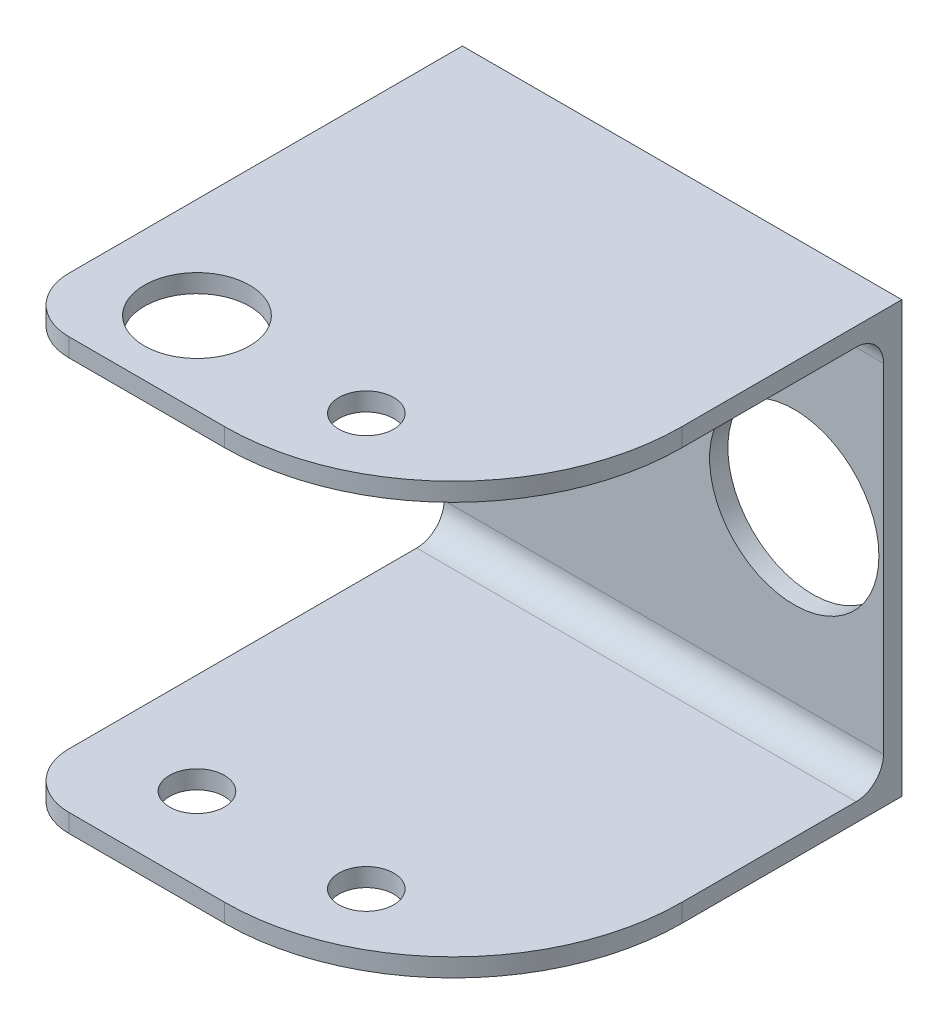
ISO-10303-21;
HEADER;
FILE_DESCRIPTION(('STEP AP214'),'2;1');
FILE_NAME('part.step','',(''),(''),'','','');
FILE_SCHEMA(('AUTOMOTIVE_DESIGN { 1 0 10303 214 1 1 1 1 }'));
ENDSEC;
DATA;
#1=APPLICATION_CONTEXT('core data for automotive mechanical design processes');
#2=APPLICATION_PROTOCOL_DEFINITION('international standard','automotive_design',2000,#1);
#3=PRODUCT_CONTEXT('',#1,'mechanical');
#4=PRODUCT('Part','Part','',(#3));
#5=PRODUCT_RELATED_PRODUCT_CATEGORY('part','',(#4));
#6=PRODUCT_DEFINITION_FORMATION('','',#4);
#7=PRODUCT_DEFINITION_CONTEXT('part definition',#1,'design');
#8=PRODUCT_DEFINITION('design','',#6,#7);
#9=PRODUCT_DEFINITION_SHAPE('','',#8);
#10=(LENGTH_UNIT() NAMED_UNIT(*) SI_UNIT(.MILLI.,.METRE.));
#11=(NAMED_UNIT(*) PLANE_ANGLE_UNIT() SI_UNIT($,.RADIAN.));
#12=(NAMED_UNIT(*) SI_UNIT($,.STERADIAN.) SOLID_ANGLE_UNIT());
#13=UNCERTAINTY_MEASURE_WITH_UNIT(LENGTH_MEASURE(1.E-05),#10,'distance_accuracy_value','');
#14=(GEOMETRIC_REPRESENTATION_CONTEXT(3) GLOBAL_UNCERTAINTY_ASSIGNED_CONTEXT((#13)) GLOBAL_UNIT_ASSIGNED_CONTEXT((#10,
#11,#12)) REPRESENTATION_CONTEXT('',''));
#15=CARTESIAN_POINT('',(0.,0.,0.));
#16=DIRECTION('',(0.,0.,1.));
#17=DIRECTION('',(1.,0.,0.));
#18=AXIS2_PLACEMENT_3D('',#15,#16,#17);
#19=CARTESIAN_POINT('',(0.,0.,49.));
#20=DIRECTION('',(0.,0.,1.));
#21=DIRECTION('',(1.,0.,0.));
#22=AXIS2_PLACEMENT_3D('',#19,#20,#21);
#23=PLANE('',#22);
#24=DIRECTION('',(1.,0.,0.));
#25=VECTOR('',#24,1.);
#26=CARTESIAN_POINT('',(0.,-21.5,49.));
#27=LINE('',#26,#25);
#28=CARTESIAN_POINT('',(-18.,-21.5,49.));
#29=VERTEX_POINT('',#28);
#30=CARTESIAN_POINT('',(-1.,-21.5,49.));
#31=VERTEX_POINT('',#30);
#32=EDGE_CURVE('E178',#29,#31,#27,.T.);
#33=ORIENTED_EDGE('',*,*,#32,.F.);
#34=DIRECTION('',(0.,-1.,0.));
#35=VECTOR('',#34,1.);
#36=CARTESIAN_POINT('',(-18.,-23.5,49.));
#37=LINE('',#36,#35);
#38=CARTESIAN_POINT('',(-18.,-23.5,49.));
#39=VERTEX_POINT('',#38);
#40=EDGE_CURVE('E201',#29,#39,#37,.T.);
#41=ORIENTED_EDGE('',*,*,#40,.T.);
#42=DIRECTION('',(1.,0.,0.));
#43=VECTOR('',#42,1.);
#44=CARTESIAN_POINT('',(-24.,-23.5,49.));
#45=LINE('',#44,#43);
#46=CARTESIAN_POINT('',(-1.,-23.5,49.));
#47=VERTEX_POINT('',#46);
#48=EDGE_CURVE('E165',#39,#47,#45,.T.);
#49=ORIENTED_EDGE('',*,*,#48,.T.);
#50=DIRECTION('',(0.,1.,0.));
#51=VECTOR('',#50,1.);
#52=CARTESIAN_POINT('',(-1.,-21.5,49.));
#53=LINE('',#52,#51);
#54=EDGE_CURVE('E193',#47,#31,#53,.T.);
#55=ORIENTED_EDGE('',*,*,#54,.T.);
#56=EDGE_LOOP('',(#33,#41,#49,#55));
#57=FACE_BOUND('',#56,.T.);
#58=ADVANCED_FACE('F33',(#57),#23,.T.);
#59=CARTESIAN_POINT('',(24.,23.5,49.));
#60=DIRECTION('',(-1.,0.,0.));
#61=DIRECTION('',(0.,-1.,0.));
#62=AXIS2_PLACEMENT_3D('',#59,#60,#61);
#63=PLANE('',#62);
#64=DIRECTION('',(0.,0.,-1.));
#65=VECTOR('',#64,1.);
#66=CARTESIAN_POINT('',(24.,23.5,49.));
#67=LINE('',#66,#65);
#68=CARTESIAN_POINT('',(24.,23.5,24.));
#69=VERTEX_POINT('',#68);
#70=CARTESIAN_POINT('',(24.,23.5,0.));
#71=VERTEX_POINT('',#70);
#72=EDGE_CURVE('E134',#69,#71,#67,.T.);
#73=ORIENTED_EDGE('',*,*,#72,.F.);
#74=DIRECTION('',(0.,1.,0.));
#75=VECTOR('',#74,1.);
#76=CARTESIAN_POINT('',(24.,21.5,24.));
#77=LINE('',#76,#75);
#78=CARTESIAN_POINT('',(24.,21.5,24.));
#79=VERTEX_POINT('',#78);
#80=EDGE_CURVE('E189',#69,#79,#77,.F.);
#81=ORIENTED_EDGE('',*,*,#80,.T.);
#82=DIRECTION('',(0.,0.,1.));
#83=VECTOR('',#82,1.);
#84=CARTESIAN_POINT('',(24.,21.5,2.));
#85=LINE('',#84,#83);
#86=CARTESIAN_POINT('',(24.,21.5,5.));
#87=VERTEX_POINT('',#86);
#88=EDGE_CURVE('E250',#87,#79,#85,.T.);
#89=ORIENTED_EDGE('',*,*,#88,.F.);
#90=CARTESIAN_POINT('',(24.,18.5,5.));
#91=DIRECTION('',(-1.,0.,0.));
#92=DIRECTION('',(0.,-1.,0.));
#93=AXIS2_PLACEMENT_3D('',#90,#91,#92);
#94=CIRCLE('',#93,3.);
#95=CARTESIAN_POINT('',(24.,18.5,2.));
#96=VERTEX_POINT('',#95);
#97=EDGE_CURVE('E229',#87,#96,#94,.T.);
#98=ORIENTED_EDGE('',*,*,#97,.T.);
#99=DIRECTION('',(0.,1.,0.));
#100=VECTOR('',#99,1.);
#101=CARTESIAN_POINT('',(24.,21.5,2.));
#102=LINE('',#101,#100);
#103=CARTESIAN_POINT('',(24.,-18.5,2.));
#104=VERTEX_POINT('',#103);
#105=EDGE_CURVE('E249',#104,#96,#102,.T.);
#106=ORIENTED_EDGE('',*,*,#105,.F.);
#107=CARTESIAN_POINT('',(24.,-18.5,4.99999999999999));
#108=DIRECTION('',(-1.,0.,0.));
#109=DIRECTION('',(0.,-1.,0.));
#110=AXIS2_PLACEMENT_3D('',#107,#108,#109);
#111=CIRCLE('',#110,3.);
#112=CARTESIAN_POINT('',(24.,-21.5,4.99999999999999));
#113=VERTEX_POINT('',#112);
#114=EDGE_CURVE('E41',#104,#113,#111,.T.);
#115=ORIENTED_EDGE('',*,*,#114,.T.);
#116=DIRECTION('',(0.,0.,-1.));
#117=VECTOR('',#116,1.);
#118=CARTESIAN_POINT('',(24.,-21.5,1.99999999999999));
#119=LINE('',#118,#117);
#120=CARTESIAN_POINT('',(24.,-21.5,24.));
#121=VERTEX_POINT('',#120);
#122=EDGE_CURVE('E245',#121,#113,#119,.T.);
#123=ORIENTED_EDGE('',*,*,#122,.F.);
#124=DIRECTION('',(0.,1.,0.));
#125=VECTOR('',#124,1.);
#126=CARTESIAN_POINT('',(24.,-23.5,24.));
#127=LINE('',#126,#125);
#128=CARTESIAN_POINT('',(24.,-23.5,24.));
#129=VERTEX_POINT('',#128);
#130=EDGE_CURVE('E187',#121,#129,#127,.F.);
#131=ORIENTED_EDGE('',*,*,#130,.T.);
#132=DIRECTION('',(0.,0.,-1.));
#133=VECTOR('',#132,1.);
#134=CARTESIAN_POINT('',(24.,-23.5,49.));
#135=LINE('',#134,#133);
#136=CARTESIAN_POINT('',(24.,-23.5,0.));
#137=VERTEX_POINT('',#136);
#138=EDGE_CURVE('E158',#129,#137,#135,.T.);
#139=ORIENTED_EDGE('',*,*,#138,.T.);
#140=DIRECTION('',(0.,1.,0.));
#141=VECTOR('',#140,1.);
#142=CARTESIAN_POINT('',(24.,23.5,0.));
#143=LINE('',#142,#141);
#144=EDGE_CURVE('E152',#137,#71,#143,.T.);
#145=ORIENTED_EDGE('',*,*,#144,.T.);
#146=EDGE_LOOP('',(#73,#81,#89,#98,#106,#115,#123,#131,#139,#145));
#147=FACE_BOUND('',#146,.T.);
#148=ADVANCED_FACE('F156',(#147),#63,.F.);
#149=CARTESIAN_POINT('',(-24.,23.5,49.));
#150=DIRECTION('',(0.,-1.,0.));
#151=DIRECTION('',(0.,0.,-1.));
#152=AXIS2_PLACEMENT_3D('',#149,#150,#151);
#153=PLANE('',#152);
#154=CARTESIAN_POINT('',(-13.,23.5,40.));
#155=DIRECTION('',(0.,1.,0.));
#156=DIRECTION('',(0.,0.,1.));
#157=AXIS2_PLACEMENT_3D('',#154,#155,#156);
#158=CIRCLE('',#157,5.75);
#159=CARTESIAN_POINT('',(-13.,23.5,45.75));
#160=VERTEX_POINT('',#159);
#161=EDGE_CURVE('E332',#160,#160,#158,.T.);
#162=ORIENTED_EDGE('',*,*,#161,.F.);
#163=EDGE_LOOP('',(#162));
#164=FACE_BOUND('',#163,.T.);
#165=CARTESIAN_POINT('',(5.49999999999999,23.5,40.));
#166=DIRECTION('',(0.,1.,0.));
#167=DIRECTION('',(0.,0.,1.));
#168=AXIS2_PLACEMENT_3D('',#165,#166,#167);
#169=CIRCLE('',#168,3.);
#170=CARTESIAN_POINT('',(5.49999999999999,23.5,43.));
#171=VERTEX_POINT('',#170);
#172=EDGE_CURVE('E335',#171,#171,#169,.T.);
#173=ORIENTED_EDGE('',*,*,#172,.F.);
#174=EDGE_LOOP('',(#173));
#175=FACE_BOUND('',#174,.T.);
#176=DIRECTION('',(0.,0.,-1.));
#177=VECTOR('',#176,1.);
#178=CARTESIAN_POINT('',(-24.,23.5,49.));
#179=LINE('',#178,#177);
#180=CARTESIAN_POINT('',(-24.,23.5,43.));
#181=VERTEX_POINT('',#180);
#182=CARTESIAN_POINT('',(-24.,23.5,0.));
#183=VERTEX_POINT('',#182);
#184=EDGE_CURVE('E146',#181,#183,#179,.T.);
#185=ORIENTED_EDGE('',*,*,#184,.F.);
#186=CARTESIAN_POINT('',(-18.,23.5,43.));
#187=DIRECTION('',(0.,-1.,0.));
#188=DIRECTION('',(0.,0.,-1.));
#189=AXIS2_PLACEMENT_3D('',#186,#187,#188);
#190=CIRCLE('',#189,6.);
#191=CARTESIAN_POINT('',(-18.,23.5,49.));
#192=VERTEX_POINT('',#191);
#193=EDGE_CURVE('E218',#181,#192,#190,.F.);
#194=ORIENTED_EDGE('',*,*,#193,.T.);
#195=DIRECTION('',(-1.,0.,0.));
#196=VECTOR('',#195,1.);
#197=CARTESIAN_POINT('',(-24.,23.5,49.));
#198=LINE('',#197,#196);
#199=CARTESIAN_POINT('',(-1.00000000000001,23.5,49.));
#200=VERTEX_POINT('',#199);
#201=EDGE_CURVE('E171',#200,#192,#198,.T.);
#202=ORIENTED_EDGE('',*,*,#201,.F.);
#203=CARTESIAN_POINT('',(-1.00000000000001,23.5,24.));
#204=DIRECTION('',(0.,-1.,0.));
#205=DIRECTION('',(0.,0.,-1.));
#206=AXIS2_PLACEMENT_3D('',#203,#204,#205);
#207=CIRCLE('',#206,25.);
#208=EDGE_CURVE('E141',#200,#69,#207,.F.);
#209=ORIENTED_EDGE('',*,*,#208,.T.);
#210=ORIENTED_EDGE('',*,*,#72,.T.);
#211=DIRECTION('',(-1.,0.,0.));
#212=VECTOR('',#211,1.);
#213=CARTESIAN_POINT('',(-24.,23.5,0.));
#214=LINE('',#213,#212);
#215=EDGE_CURVE('E138',#71,#183,#214,.T.);
#216=ORIENTED_EDGE('',*,*,#215,.T.);
#217=EDGE_LOOP('',(#185,#194,#202,#209,#210,#216));
#218=FACE_BOUND('',#217,.T.);
#219=ADVANCED_FACE('F137',(#164,#175,#218),#153,.F.);
#220=CARTESIAN_POINT('',(-24.,23.5,49.));
#221=DIRECTION('',(1.,0.,0.));
#222=DIRECTION('',(0.,1.,0.));
#223=AXIS2_PLACEMENT_3D('',#220,#221,#222);
#224=PLANE('',#223);
#225=DIRECTION('',(0.,0.,-1.));
#226=VECTOR('',#225,1.);
#227=CARTESIAN_POINT('',(-24.,-23.5,49.));
#228=LINE('',#227,#226);
#229=CARTESIAN_POINT('',(-24.,-23.5,43.));
#230=VERTEX_POINT('',#229);
#231=CARTESIAN_POINT('',(-24.,-23.5,0.));
#232=VERTEX_POINT('',#231);
#233=EDGE_CURVE('E173',#230,#232,#228,.T.);
#234=ORIENTED_EDGE('',*,*,#233,.F.);
#235=DIRECTION('',(0.,-1.,0.));
#236=VECTOR('',#235,1.);
#237=CARTESIAN_POINT('',(-24.,-21.5,43.));
#238=LINE('',#237,#236);
#239=CARTESIAN_POINT('',(-24.,-21.5,43.));
#240=VERTEX_POINT('',#239);
#241=EDGE_CURVE('E208',#230,#240,#238,.F.);
#242=ORIENTED_EDGE('',*,*,#241,.T.);
#243=DIRECTION('',(0.,0.,-1.));
#244=VECTOR('',#243,1.);
#245=CARTESIAN_POINT('',(-24.,-21.5,49.));
#246=LINE('',#245,#244);
#247=CARTESIAN_POINT('',(-24.,-21.5,5.));
#248=VERTEX_POINT('',#247);
#249=EDGE_CURVE('E160',#240,#248,#246,.T.);
#250=ORIENTED_EDGE('',*,*,#249,.T.);
#251=CARTESIAN_POINT('',(-24.,-18.5,4.99999999999999));
#252=DIRECTION('',(1.,0.,0.));
#253=DIRECTION('',(0.,1.,0.));
#254=AXIS2_PLACEMENT_3D('',#251,#252,#253);
#255=CIRCLE('',#254,3.);
#256=CARTESIAN_POINT('',(-24.,-18.5,2.));
#257=VERTEX_POINT('',#256);
#258=EDGE_CURVE('E11',#248,#257,#255,.T.);
#259=ORIENTED_EDGE('',*,*,#258,.T.);
#260=DIRECTION('',(0.,1.,0.));
#261=VECTOR('',#260,1.);
#262=CARTESIAN_POINT('',(-24.,23.5,2.));
#263=LINE('',#262,#261);
#264=CARTESIAN_POINT('',(-24.,18.5,2.));
#265=VERTEX_POINT('',#264);
#266=EDGE_CURVE('E180',#257,#265,#263,.T.);
#267=ORIENTED_EDGE('',*,*,#266,.T.);
#268=CARTESIAN_POINT('',(-24.,18.5,5.));
#269=DIRECTION('',(1.,0.,0.));
#270=DIRECTION('',(0.,1.,0.));
#271=AXIS2_PLACEMENT_3D('',#268,#269,#270);
#272=CIRCLE('',#271,3.);
#273=CARTESIAN_POINT('',(-24.,21.5,5.));
#274=VERTEX_POINT('',#273);
#275=EDGE_CURVE('E231',#265,#274,#272,.T.);
#276=ORIENTED_EDGE('',*,*,#275,.T.);
#277=DIRECTION('',(0.,0.,1.));
#278=VECTOR('',#277,1.);
#279=CARTESIAN_POINT('',(-24.,21.5,49.));
#280=LINE('',#279,#278);
#281=CARTESIAN_POINT('',(-24.,21.5,43.));
#282=VERTEX_POINT('',#281);
#283=EDGE_CURVE('E162',#274,#282,#280,.T.);
#284=ORIENTED_EDGE('',*,*,#283,.T.);
#285=DIRECTION('',(0.,-1.,0.));
#286=VECTOR('',#285,1.);
#287=CARTESIAN_POINT('',(-24.,23.5,43.));
#288=LINE('',#287,#286);
#289=EDGE_CURVE('E206',#282,#181,#288,.F.);
#290=ORIENTED_EDGE('',*,*,#289,.T.);
#291=ORIENTED_EDGE('',*,*,#184,.T.);
#292=DIRECTION('',(0.,-1.,0.));
#293=VECTOR('',#292,1.);
#294=CARTESIAN_POINT('',(-24.,23.5,0.));
#295=LINE('',#294,#293);
#296=EDGE_CURVE('E154',#183,#232,#295,.T.);
#297=ORIENTED_EDGE('',*,*,#296,.T.);
#298=EDGE_LOOP('',(#234,#242,#250,#259,#267,#276,#284,#290,#291,#297));
#299=FACE_BOUND('',#298,.T.);
#300=ADVANCED_FACE('F236',(#299),#224,.F.);
#301=CARTESIAN_POINT('',(-24.,-23.5,49.));
#302=DIRECTION('',(0.,1.,0.));
#303=DIRECTION('',(0.,0.,1.));
#304=AXIS2_PLACEMENT_3D('',#301,#302,#303);
#305=PLANE('',#304);
#306=CARTESIAN_POINT('',(5.5,-23.5,40.));
#307=DIRECTION('',(0.,1.,0.));
#308=DIRECTION('',(-1.,0.,0.));
#309=AXIS2_PLACEMENT_3D('',#306,#307,#308);
#310=CIRCLE('',#309,3.);
#311=CARTESIAN_POINT('',(2.49999999999999,-23.5,40.));
#312=VERTEX_POINT('',#311);
#313=EDGE_CURVE('E338',#312,#312,#310,.T.);
#314=ORIENTED_EDGE('',*,*,#313,.T.);
#315=EDGE_LOOP('',(#314));
#316=FACE_BOUND('',#315,.T.);
#317=CARTESIAN_POINT('',(-13.,-23.5,40.));
#318=DIRECTION('',(0.,1.,0.));
#319=DIRECTION('',(-1.,0.,0.));
#320=AXIS2_PLACEMENT_3D('',#317,#318,#319);
#321=CIRCLE('',#320,3.);
#322=CARTESIAN_POINT('',(-16.,-23.5,40.));
#323=VERTEX_POINT('',#322);
#324=EDGE_CURVE('E352',#323,#323,#321,.T.);
#325=ORIENTED_EDGE('',*,*,#324,.T.);
#326=EDGE_LOOP('',(#325));
#327=FACE_BOUND('',#326,.T.);
#328=ORIENTED_EDGE('',*,*,#48,.F.);
#329=CARTESIAN_POINT('',(-18.,-23.5,43.));
#330=DIRECTION('',(0.,1.,0.));
#331=DIRECTION('',(0.,0.,1.));
#332=AXIS2_PLACEMENT_3D('',#329,#330,#331);
#333=CIRCLE('',#332,6.);
#334=EDGE_CURVE('E204',#39,#230,#333,.F.);
#335=ORIENTED_EDGE('',*,*,#334,.T.);
#336=ORIENTED_EDGE('',*,*,#233,.T.);
#337=DIRECTION('',(1.,0.,0.));
#338=VECTOR('',#337,1.);
#339=CARTESIAN_POINT('',(-24.,-23.5,0.));
#340=LINE('',#339,#338);
#341=EDGE_CURVE('E169',#232,#137,#340,.T.);
#342=ORIENTED_EDGE('',*,*,#341,.T.);
#343=ORIENTED_EDGE('',*,*,#138,.F.);
#344=CARTESIAN_POINT('',(-1.,-23.5,24.));
#345=DIRECTION('',(0.,1.,0.));
#346=DIRECTION('',(0.,0.,1.));
#347=AXIS2_PLACEMENT_3D('',#344,#345,#346);
#348=CIRCLE('',#347,25.);
#349=EDGE_CURVE('E198',#129,#47,#348,.F.);
#350=ORIENTED_EDGE('',*,*,#349,.T.);
#351=EDGE_LOOP('',(#328,#335,#336,#342,#343,#350));
#352=FACE_BOUND('',#351,.T.);
#353=ADVANCED_FACE('F272',(#316,#327,#352),#305,.F.);
#354=ORIENTED_EDGE('',*,*,#201,.T.);
#355=DIRECTION('',(0.,-1.,0.));
#356=VECTOR('',#355,1.);
#357=CARTESIAN_POINT('',(-18.,21.5,49.));
#358=LINE('',#357,#356);
#359=CARTESIAN_POINT('',(-18.,21.5,49.));
#360=VERTEX_POINT('',#359);
#361=EDGE_CURVE('E212',#192,#360,#358,.T.);
#362=ORIENTED_EDGE('',*,*,#361,.T.);
#363=DIRECTION('',(-1.,0.,0.));
#364=VECTOR('',#363,1.);
#365=CARTESIAN_POINT('',(0.,21.5,49.));
#366=LINE('',#365,#364);
#367=CARTESIAN_POINT('',(-1.00000000000001,21.5,49.));
#368=VERTEX_POINT('',#367);
#369=EDGE_CURVE('E145',#368,#360,#366,.T.);
#370=ORIENTED_EDGE('',*,*,#369,.F.);
#371=DIRECTION('',(0.,1.,0.));
#372=VECTOR('',#371,1.);
#373=CARTESIAN_POINT('',(-1.00000000000001,23.5,49.));
#374=LINE('',#373,#372);
#375=EDGE_CURVE('E183',#368,#200,#374,.T.);
#376=ORIENTED_EDGE('',*,*,#375,.T.);
#377=EDGE_LOOP('',(#354,#362,#370,#376));
#378=FACE_BOUND('',#377,.T.);
#379=ADVANCED_FACE('F286',(#378),#23,.T.);
#380=CARTESIAN_POINT('',(0.,0.,0.));
#381=DIRECTION('',(0.,0.,1.));
#382=DIRECTION('',(1.,0.,0.));
#383=AXIS2_PLACEMENT_3D('',#380,#381,#382);
#384=PLANE('',#383);
#385=CARTESIAN_POINT('',(14.25,0.,0.));
#386=DIRECTION('',(0.,0.,1.));
#387=DIRECTION('',(1.,0.,0.));
#388=AXIS2_PLACEMENT_3D('',#385,#386,#387);
#389=CIRCLE('',#388,9.25000000000001);
#390=CARTESIAN_POINT('',(23.5,0.,0.));
#391=VERTEX_POINT('',#390);
#392=EDGE_CURVE('E254',#391,#391,#389,.T.);
#393=ORIENTED_EDGE('',*,*,#392,.T.);
#394=EDGE_LOOP('',(#393));
#395=FACE_BOUND('',#394,.T.);
#396=ORIENTED_EDGE('',*,*,#144,.F.);
#397=ORIENTED_EDGE('',*,*,#341,.F.);
#398=ORIENTED_EDGE('',*,*,#296,.F.);
#399=ORIENTED_EDGE('',*,*,#215,.F.);
#400=EDGE_LOOP('',(#396,#397,#398,#399));
#401=FACE_BOUND('',#400,.T.);
#402=ADVANCED_FACE('F150',(#395,#401),#384,.F.);
#403=CARTESIAN_POINT('',(-25.,21.5,2.));
#404=DIRECTION('',(0.,0.,-1.));
#405=DIRECTION('',(0.,1.,0.));
#406=AXIS2_PLACEMENT_3D('',#403,#404,#405);
#407=PLANE('',#406);
#408=CARTESIAN_POINT('',(14.25,0.,2.));
#409=DIRECTION('',(0.,0.,1.));
#410=DIRECTION('',(1.,0.,0.));
#411=AXIS2_PLACEMENT_3D('',#408,#409,#410);
#412=CIRCLE('',#411,9.25000000000001);
#413=CARTESIAN_POINT('',(23.5,0.,2.));
#414=VERTEX_POINT('',#413);
#415=EDGE_CURVE('E258',#414,#414,#412,.T.);
#416=ORIENTED_EDGE('',*,*,#415,.F.);
#417=EDGE_LOOP('',(#416));
#418=FACE_BOUND('',#417,.T.);
#419=ORIENTED_EDGE('',*,*,#105,.T.);
#420=DIRECTION('',(1.,0.,0.));
#421=VECTOR('',#420,1.);
#422=CARTESIAN_POINT('',(-24.,18.5,2.));
#423=LINE('',#422,#421);
#424=EDGE_CURVE('E226',#96,#265,#423,.F.);
#425=ORIENTED_EDGE('',*,*,#424,.T.);
#426=ORIENTED_EDGE('',*,*,#266,.F.);
#427=DIRECTION('',(1.,0.,0.));
#428=VECTOR('',#427,1.);
#429=CARTESIAN_POINT('',(24.,-18.5,2.));
#430=LINE('',#429,#428);
#431=EDGE_CURVE('E223',#257,#104,#430,.T.);
#432=ORIENTED_EDGE('',*,*,#431,.T.);
#433=EDGE_LOOP('',(#419,#425,#426,#432));
#434=FACE_BOUND('',#433,.T.);
#435=ADVANCED_FACE('F252',(#418,#434),#407,.F.);
#436=CARTESIAN_POINT('',(-25.,-21.5,1.99999999999999));
#437=DIRECTION('',(0.,-1.,0.));
#438=DIRECTION('',(1.,0.,0.));
#439=AXIS2_PLACEMENT_3D('',#436,#437,#438);
#440=PLANE('',#439);
#441=CARTESIAN_POINT('',(5.5,-21.5,40.));
#442=DIRECTION('',(0.,1.,0.));
#443=DIRECTION('',(-1.,0.,0.));
#444=AXIS2_PLACEMENT_3D('',#441,#442,#443);
#445=CIRCLE('',#444,3.);
#446=CARTESIAN_POINT('',(2.49999999999999,-21.5,40.));
#447=VERTEX_POINT('',#446);
#448=EDGE_CURVE('E342',#447,#447,#445,.T.);
#449=ORIENTED_EDGE('',*,*,#448,.F.);
#450=EDGE_LOOP('',(#449));
#451=FACE_BOUND('',#450,.T.);
#452=CARTESIAN_POINT('',(-13.,-21.5,40.));
#453=DIRECTION('',(0.,1.,0.));
#454=DIRECTION('',(-1.,0.,0.));
#455=AXIS2_PLACEMENT_3D('',#452,#453,#454);
#456=CIRCLE('',#455,3.);
#457=CARTESIAN_POINT('',(-16.,-21.5,40.));
#458=VERTEX_POINT('',#457);
#459=EDGE_CURVE('E349',#458,#458,#456,.T.);
#460=ORIENTED_EDGE('',*,*,#459,.F.);
#461=EDGE_LOOP('',(#460));
#462=FACE_BOUND('',#461,.T.);
#463=ORIENTED_EDGE('',*,*,#122,.T.);
#464=DIRECTION('',(1.,0.,0.));
#465=VECTOR('',#464,1.);
#466=CARTESIAN_POINT('',(-24.,-21.5,4.99999999999999));
#467=LINE('',#466,#465);
#468=EDGE_CURVE('E54',#113,#248,#467,.F.);
#469=ORIENTED_EDGE('',*,*,#468,.T.);
#470=ORIENTED_EDGE('',*,*,#249,.F.);
#471=CARTESIAN_POINT('',(-18.,-21.5,43.));
#472=DIRECTION('',(0.,-1.,0.));
#473=DIRECTION('',(1.,0.,0.));
#474=AXIS2_PLACEMENT_3D('',#471,#472,#473);
#475=CIRCLE('',#474,6.);
#476=EDGE_CURVE('E210',#240,#29,#475,.F.);
#477=ORIENTED_EDGE('',*,*,#476,.T.);
#478=ORIENTED_EDGE('',*,*,#32,.T.);
#479=CARTESIAN_POINT('',(-1.,-21.5,24.));
#480=DIRECTION('',(0.,-1.,0.));
#481=DIRECTION('',(1.,0.,0.));
#482=AXIS2_PLACEMENT_3D('',#479,#480,#481);
#483=CIRCLE('',#482,25.);
#484=EDGE_CURVE('E196',#31,#121,#483,.F.);
#485=ORIENTED_EDGE('',*,*,#484,.T.);
#486=EDGE_LOOP('',(#463,#469,#470,#477,#478,#485));
#487=FACE_BOUND('',#486,.T.);
#488=ADVANCED_FACE('F277',(#451,#462,#487),#440,.F.);
#489=CARTESIAN_POINT('',(-25.,21.5,2.));
#490=DIRECTION('',(0.,1.,0.));
#491=DIRECTION('',(-1.,0.,0.));
#492=AXIS2_PLACEMENT_3D('',#489,#490,#491);
#493=PLANE('',#492);
#494=CARTESIAN_POINT('',(-13.,21.5,40.));
#495=DIRECTION('',(0.,1.,0.));
#496=DIRECTION('',(0.,0.,1.));
#497=AXIS2_PLACEMENT_3D('',#494,#495,#496);
#498=CIRCLE('',#497,5.75);
#499=CARTESIAN_POINT('',(-13.,21.5,45.75));
#500=VERTEX_POINT('',#499);
#501=EDGE_CURVE('E346',#500,#500,#498,.T.);
#502=ORIENTED_EDGE('',*,*,#501,.T.);
#503=EDGE_LOOP('',(#502));
#504=FACE_BOUND('',#503,.T.);
#505=CARTESIAN_POINT('',(5.49999999999999,21.5,40.));
#506=DIRECTION('',(0.,1.,0.));
#507=DIRECTION('',(0.,0.,1.));
#508=AXIS2_PLACEMENT_3D('',#505,#506,#507);
#509=CIRCLE('',#508,3.);
#510=CARTESIAN_POINT('',(5.49999999999999,21.5,43.));
#511=VERTEX_POINT('',#510);
#512=EDGE_CURVE('E337',#511,#511,#509,.T.);
#513=ORIENTED_EDGE('',*,*,#512,.T.);
#514=EDGE_LOOP('',(#513));
#515=FACE_BOUND('',#514,.T.);
#516=ORIENTED_EDGE('',*,*,#283,.F.);
#517=DIRECTION('',(1.,0.,0.));
#518=VECTOR('',#517,1.);
#519=CARTESIAN_POINT('',(24.,21.5,5.));
#520=LINE('',#519,#518);
#521=EDGE_CURVE('E220',#274,#87,#520,.T.);
#522=ORIENTED_EDGE('',*,*,#521,.T.);
#523=ORIENTED_EDGE('',*,*,#88,.T.);
#524=CARTESIAN_POINT('',(-1.00000000000001,21.5,24.));
#525=DIRECTION('',(0.,1.,0.));
#526=DIRECTION('',(-1.,0.,0.));
#527=AXIS2_PLACEMENT_3D('',#524,#525,#526);
#528=CIRCLE('',#527,25.);
#529=EDGE_CURVE('E191',#79,#368,#528,.F.);
#530=ORIENTED_EDGE('',*,*,#529,.T.);
#531=ORIENTED_EDGE('',*,*,#369,.T.);
#532=CARTESIAN_POINT('',(-18.,21.5,43.));
#533=DIRECTION('',(0.,1.,0.));
#534=DIRECTION('',(-1.,0.,0.));
#535=AXIS2_PLACEMENT_3D('',#532,#533,#534);
#536=CIRCLE('',#535,6.);
#537=EDGE_CURVE('E215',#360,#282,#536,.F.);
#538=ORIENTED_EDGE('',*,*,#537,.T.);
#539=EDGE_LOOP('',(#516,#522,#523,#530,#531,#538));
#540=FACE_BOUND('',#539,.T.);
#541=ADVANCED_FACE('F242',(#504,#515,#540),#493,.F.);
#542=CARTESIAN_POINT('',(14.25,0.,0.));
#543=DIRECTION('',(0.,0.,1.));
#544=DIRECTION('',(1.,0.,0.));
#545=AXIS2_PLACEMENT_3D('',#542,#543,#544);
#546=CYLINDRICAL_SURFACE('',#545,9.25000000000001);
#547=ORIENTED_EDGE('',*,*,#392,.F.);
#548=EDGE_LOOP('',(#547));
#549=FACE_BOUND('',#548,.T.);
#550=ORIENTED_EDGE('',*,*,#415,.T.);
#551=EDGE_LOOP('',(#550));
#552=FACE_BOUND('',#551,.T.);
#553=ADVANCED_FACE('F378',(#549,#552),#546,.F.);
#554=CARTESIAN_POINT('',(5.49999999999999,21.5,40.));
#555=DIRECTION('',(0.,1.,0.));
#556=DIRECTION('',(0.,0.,1.));
#557=AXIS2_PLACEMENT_3D('',#554,#555,#556);
#558=CYLINDRICAL_SURFACE('',#557,3.);
#559=ORIENTED_EDGE('',*,*,#512,.F.);
#560=EDGE_LOOP('',(#559));
#561=FACE_BOUND('',#560,.T.);
#562=ORIENTED_EDGE('',*,*,#172,.T.);
#563=EDGE_LOOP('',(#562));
#564=FACE_BOUND('',#563,.T.);
#565=ADVANCED_FACE('F371',(#561,#564),#558,.F.);
#566=CARTESIAN_POINT('',(-13.,21.5,40.));
#567=DIRECTION('',(0.,1.,0.));
#568=DIRECTION('',(0.,0.,1.));
#569=AXIS2_PLACEMENT_3D('',#566,#567,#568);
#570=CYLINDRICAL_SURFACE('',#569,5.75);
#571=ORIENTED_EDGE('',*,*,#501,.F.);
#572=EDGE_LOOP('',(#571));
#573=FACE_BOUND('',#572,.T.);
#574=ORIENTED_EDGE('',*,*,#161,.T.);
#575=EDGE_LOOP('',(#574));
#576=FACE_BOUND('',#575,.T.);
#577=ADVANCED_FACE('F365',(#573,#576),#570,.F.);
#578=CARTESIAN_POINT('',(-13.,-23.5,40.));
#579=DIRECTION('',(0.,1.,0.));
#580=DIRECTION('',(-1.,0.,0.));
#581=AXIS2_PLACEMENT_3D('',#578,#579,#580);
#582=CYLINDRICAL_SURFACE('',#581,3.);
#583=ORIENTED_EDGE('',*,*,#324,.F.);
#584=EDGE_LOOP('',(#583));
#585=FACE_BOUND('',#584,.T.);
#586=ORIENTED_EDGE('',*,*,#459,.T.);
#587=EDGE_LOOP('',(#586));
#588=FACE_BOUND('',#587,.T.);
#589=ADVANCED_FACE('F299',(#585,#588),#582,.F.);
#590=CARTESIAN_POINT('',(5.5,-23.5,40.));
#591=DIRECTION('',(0.,1.,0.));
#592=DIRECTION('',(-1.,0.,0.));
#593=AXIS2_PLACEMENT_3D('',#590,#591,#592);
#594=CYLINDRICAL_SURFACE('',#593,3.);
#595=ORIENTED_EDGE('',*,*,#313,.F.);
#596=EDGE_LOOP('',(#595));
#597=FACE_BOUND('',#596,.T.);
#598=ORIENTED_EDGE('',*,*,#448,.T.);
#599=EDGE_LOOP('',(#598));
#600=FACE_BOUND('',#599,.T.);
#601=ADVANCED_FACE('F292',(#597,#600),#594,.F.);
#602=CARTESIAN_POINT('',(-1.,0.,24.));
#603=DIRECTION('',(0.,-1.,0.));
#604=DIRECTION('',(1.,0.,0.));
#605=AXIS2_PLACEMENT_3D('',#602,#603,#604);
#606=CYLINDRICAL_SURFACE('',#605,25.);
#607=ORIENTED_EDGE('',*,*,#529,.F.);
#608=ORIENTED_EDGE('',*,*,#80,.F.);
#609=ORIENTED_EDGE('',*,*,#208,.F.);
#610=ORIENTED_EDGE('',*,*,#375,.F.);
#611=EDGE_LOOP('',(#607,#608,#609,#610));
#612=FACE_BOUND('',#611,.T.);
#613=ADVANCED_FACE('F290',(#612),#606,.T.);
#614=CARTESIAN_POINT('',(-1.,0.,24.));
#615=DIRECTION('',(0.,-1.,0.));
#616=DIRECTION('',(1.,0.,0.));
#617=AXIS2_PLACEMENT_3D('',#614,#615,#616);
#618=CYLINDRICAL_SURFACE('',#617,25.);
#619=ORIENTED_EDGE('',*,*,#349,.F.);
#620=ORIENTED_EDGE('',*,*,#130,.F.);
#621=ORIENTED_EDGE('',*,*,#484,.F.);
#622=ORIENTED_EDGE('',*,*,#54,.F.);
#623=EDGE_LOOP('',(#619,#620,#621,#622));
#624=FACE_BOUND('',#623,.T.);
#625=ADVANCED_FACE('F276',(#624),#618,.T.);
#626=CARTESIAN_POINT('',(-18.,0.,43.));
#627=DIRECTION('',(0.,1.,0.));
#628=DIRECTION('',(-1.,0.,0.));
#629=AXIS2_PLACEMENT_3D('',#626,#627,#628);
#630=CYLINDRICAL_SURFACE('',#629,6.);
#631=ORIENTED_EDGE('',*,*,#476,.F.);
#632=ORIENTED_EDGE('',*,*,#241,.F.);
#633=ORIENTED_EDGE('',*,*,#334,.F.);
#634=ORIENTED_EDGE('',*,*,#40,.F.);
#635=EDGE_LOOP('',(#631,#632,#633,#634));
#636=FACE_BOUND('',#635,.T.);
#637=ADVANCED_FACE('F280',(#636),#630,.T.);
#638=CARTESIAN_POINT('',(-18.,0.,43.));
#639=DIRECTION('',(0.,1.,0.));
#640=DIRECTION('',(-1.,0.,0.));
#641=AXIS2_PLACEMENT_3D('',#638,#639,#640);
#642=CYLINDRICAL_SURFACE('',#641,6.);
#643=ORIENTED_EDGE('',*,*,#193,.F.);
#644=ORIENTED_EDGE('',*,*,#289,.F.);
#645=ORIENTED_EDGE('',*,*,#537,.F.);
#646=ORIENTED_EDGE('',*,*,#361,.F.);
#647=EDGE_LOOP('',(#643,#644,#645,#646));
#648=FACE_BOUND('',#647,.T.);
#649=ADVANCED_FACE('F284',(#648),#642,.T.);
#650=CARTESIAN_POINT('',(-25.,18.5,5.));
#651=DIRECTION('',(-1.,0.,0.));
#652=DIRECTION('',(0.,-1.,0.));
#653=AXIS2_PLACEMENT_3D('',#650,#651,#652);
#654=CYLINDRICAL_SURFACE('',#653,3.);
#655=ORIENTED_EDGE('',*,*,#275,.F.);
#656=ORIENTED_EDGE('',*,*,#424,.F.);
#657=ORIENTED_EDGE('',*,*,#97,.F.);
#658=ORIENTED_EDGE('',*,*,#521,.F.);
#659=EDGE_LOOP('',(#655,#656,#657,#658));
#660=FACE_BOUND('',#659,.T.);
#661=ADVANCED_FACE('F247',(#660),#654,.F.);
#662=CARTESIAN_POINT('',(-25.,-18.5,4.99999999999999));
#663=DIRECTION('',(-1.,0.,0.));
#664=DIRECTION('',(0.,-1.,0.));
#665=AXIS2_PLACEMENT_3D('',#662,#663,#664);
#666=CYLINDRICAL_SURFACE('',#665,3.);
#667=ORIENTED_EDGE('',*,*,#258,.F.);
#668=ORIENTED_EDGE('',*,*,#468,.F.);
#669=ORIENTED_EDGE('',*,*,#114,.F.);
#670=ORIENTED_EDGE('',*,*,#431,.F.);
#671=EDGE_LOOP('',(#667,#668,#669,#670));
#672=FACE_BOUND('',#671,.T.);
#673=ADVANCED_FACE('F35',(#672),#666,.F.);
#674=CLOSED_SHELL('',(#58,#148,#219,#300,#353,#379,#402,#435,#488,#541,#553,#565,#577,#589,#601,
#613,#625,#637,#649,#661,#673));
#675=MANIFOLD_SOLID_BREP('B2',#674);
#676=ADVANCED_BREP_SHAPE_REPRESENTATION('',(#18,#675),#14);
#677=SHAPE_DEFINITION_REPRESENTATION(#9,#676);
ENDSEC;
END-ISO-10303-21;
